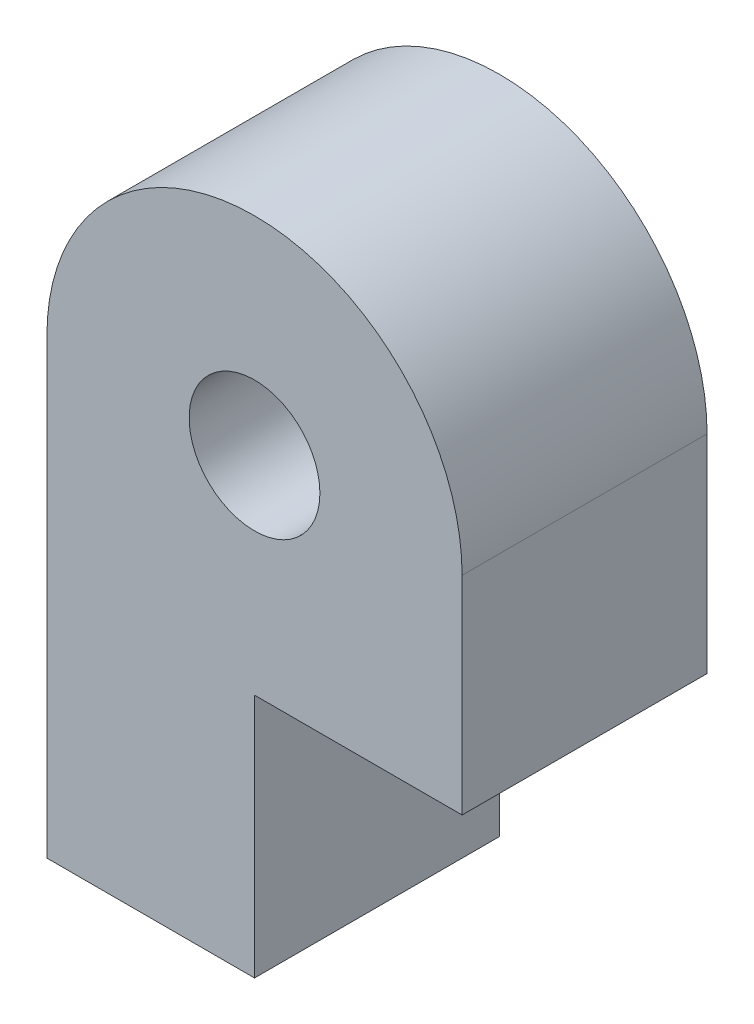
ISO-10303-21;
HEADER;
FILE_DESCRIPTION(('STEP AP214'),'2;1');
FILE_NAME('part.step','',(''),(''),'','','');
FILE_SCHEMA(('AUTOMOTIVE_DESIGN { 1 0 10303 214 1 1 1 1 }'));
ENDSEC;
DATA;
#1=APPLICATION_CONTEXT('core data for automotive mechanical design processes');
#2=APPLICATION_PROTOCOL_DEFINITION('international standard','automotive_design',2000,#1);
#3=PRODUCT_CONTEXT('',#1,'mechanical');
#4=PRODUCT('Part','Part','',(#3));
#5=PRODUCT_RELATED_PRODUCT_CATEGORY('part','',(#4));
#6=PRODUCT_DEFINITION_FORMATION('','',#4);
#7=PRODUCT_DEFINITION_CONTEXT('part definition',#1,'design');
#8=PRODUCT_DEFINITION('design','',#6,#7);
#9=PRODUCT_DEFINITION_SHAPE('','',#8);
#10=(LENGTH_UNIT() NAMED_UNIT(*) SI_UNIT(.MILLI.,.METRE.));
#11=(NAMED_UNIT(*) PLANE_ANGLE_UNIT() SI_UNIT($,.RADIAN.));
#12=(NAMED_UNIT(*) SI_UNIT($,.STERADIAN.) SOLID_ANGLE_UNIT());
#13=UNCERTAINTY_MEASURE_WITH_UNIT(LENGTH_MEASURE(1.E-05),#10,'distance_accuracy_value','');
#14=(GEOMETRIC_REPRESENTATION_CONTEXT(3) GLOBAL_UNCERTAINTY_ASSIGNED_CONTEXT((#13)) GLOBAL_UNIT_ASSIGNED_CONTEXT((#10,
#11,#12)) REPRESENTATION_CONTEXT('',''));
#15=CARTESIAN_POINT('',(0.,0.,0.));
#16=DIRECTION('',(0.,0.,1.));
#17=DIRECTION('',(1.,0.,0.));
#18=AXIS2_PLACEMENT_3D('',#15,#16,#17);
#19=CARTESIAN_POINT('',(0.,0.,5.9944));
#20=DIRECTION('',(0.,0.,1.));
#21=DIRECTION('',(1.,0.,0.));
#22=AXIS2_PLACEMENT_3D('',#19,#20,#21);
#23=PLANE('',#22);
#24=CARTESIAN_POINT('',(0.,0.,5.9944));
#25=DIRECTION('',(0.,0.,1.));
#26=DIRECTION('',(1.,0.,0.));
#27=AXIS2_PLACEMENT_3D('',#24,#25,#26);
#28=CIRCLE('',#27,5.08);
#29=CARTESIAN_POINT('',(5.08,0.,5.9944));
#30=VERTEX_POINT('',#29);
#31=CARTESIAN_POINT('',(-5.08,0.,5.9944));
#32=VERTEX_POINT('',#31);
#33=EDGE_CURVE('E129',#30,#32,#28,.T.);
#34=ORIENTED_EDGE('',*,*,#33,.T.);
#35=DIRECTION('',(0.,-1.,0.));
#36=VECTOR('',#35,1.);
#37=CARTESIAN_POINT('',(-5.08,0.,5.9944));
#38=LINE('',#37,#36);
#39=CARTESIAN_POINT('',(-5.08,-11.0744,5.9944));
#40=VERTEX_POINT('',#39);
#41=EDGE_CURVE('E87',#32,#40,#38,.T.);
#42=ORIENTED_EDGE('',*,*,#41,.T.);
#43=DIRECTION('',(1.,0.,0.));
#44=VECTOR('',#43,1.);
#45=CARTESIAN_POINT('',(-5.08,-11.0744,5.9944));
#46=LINE('',#45,#44);
#47=CARTESIAN_POINT('',(0.,-11.0744,5.9944));
#48=VERTEX_POINT('',#47);
#49=EDGE_CURVE('E100',#40,#48,#46,.T.);
#50=ORIENTED_EDGE('',*,*,#49,.T.);
#51=DIRECTION('',(0.,1.,0.));
#52=VECTOR('',#51,1.);
#53=CARTESIAN_POINT('',(0.,-11.0744,5.9944));
#54=LINE('',#53,#52);
#55=CARTESIAN_POINT('',(0.,-5.08,5.9944));
#56=VERTEX_POINT('',#55);
#57=EDGE_CURVE('E94',#48,#56,#54,.T.);
#58=ORIENTED_EDGE('',*,*,#57,.T.);
#59=DIRECTION('',(1.,0.,0.));
#60=VECTOR('',#59,1.);
#61=CARTESIAN_POINT('',(5.08,-5.08,5.9944));
#62=LINE('',#61,#60);
#63=CARTESIAN_POINT('',(5.08,-5.08,5.9944));
#64=VERTEX_POINT('',#63);
#65=EDGE_CURVE('E98',#56,#64,#62,.T.);
#66=ORIENTED_EDGE('',*,*,#65,.T.);
#67=DIRECTION('',(0.,1.,0.));
#68=VECTOR('',#67,1.);
#69=CARTESIAN_POINT('',(5.08,0.,5.9944));
#70=LINE('',#69,#68);
#71=EDGE_CURVE('E50',#64,#30,#70,.T.);
#72=ORIENTED_EDGE('',*,*,#71,.T.);
#73=EDGE_LOOP('',(#34,#42,#50,#58,#66,#72));
#74=FACE_BOUND('',#73,.T.);
#75=CARTESIAN_POINT('',(0.,0.,5.9944));
#76=DIRECTION('',(0.,0.,1.));
#77=DIRECTION('',(1.,0.,0.));
#78=AXIS2_PLACEMENT_3D('',#75,#76,#77);
#79=CIRCLE('',#78,1.6);
#80=CARTESIAN_POINT('',(1.6,0.,5.9944));
#81=VERTEX_POINT('',#80);
#82=EDGE_CURVE('E122',#81,#81,#79,.T.);
#83=ORIENTED_EDGE('',*,*,#82,.F.);
#84=EDGE_LOOP('',(#83));
#85=FACE_BOUND('',#84,.T.);
#86=ADVANCED_FACE('F33',(#74,#85),#23,.T.);
#87=CARTESIAN_POINT('',(0.,0.,0.));
#88=DIRECTION('',(0.,0.,1.));
#89=DIRECTION('',(1.,0.,0.));
#90=AXIS2_PLACEMENT_3D('',#87,#88,#89);
#91=PLANE('',#90);
#92=CARTESIAN_POINT('',(0.,0.,0.));
#93=DIRECTION('',(0.,0.,1.));
#94=DIRECTION('',(1.,0.,0.));
#95=AXIS2_PLACEMENT_3D('',#92,#93,#94);
#96=CIRCLE('',#95,5.08);
#97=CARTESIAN_POINT('',(5.08,0.,0.));
#98=VERTEX_POINT('',#97);
#99=CARTESIAN_POINT('',(-5.08,0.,0.));
#100=VERTEX_POINT('',#99);
#101=EDGE_CURVE('E118',#98,#100,#96,.T.);
#102=ORIENTED_EDGE('',*,*,#101,.F.);
#103=DIRECTION('',(0.,1.,0.));
#104=VECTOR('',#103,1.);
#105=CARTESIAN_POINT('',(5.08,0.,0.));
#106=LINE('',#105,#104);
#107=CARTESIAN_POINT('',(5.08,-5.08,0.));
#108=VERTEX_POINT('',#107);
#109=EDGE_CURVE('E79',#108,#98,#106,.T.);
#110=ORIENTED_EDGE('',*,*,#109,.F.);
#111=DIRECTION('',(1.,0.,0.));
#112=VECTOR('',#111,1.);
#113=CARTESIAN_POINT('',(5.08,-5.08,0.));
#114=LINE('',#113,#112);
#115=CARTESIAN_POINT('',(0.,-5.08,0.));
#116=VERTEX_POINT('',#115);
#117=EDGE_CURVE('E73',#116,#108,#114,.T.);
#118=ORIENTED_EDGE('',*,*,#117,.F.);
#119=DIRECTION('',(0.,1.,0.));
#120=VECTOR('',#119,1.);
#121=CARTESIAN_POINT('',(0.,-11.0744,0.));
#122=LINE('',#121,#120);
#123=CARTESIAN_POINT('',(0.,-11.0744,0.));
#124=VERTEX_POINT('',#123);
#125=EDGE_CURVE('E108',#124,#116,#122,.T.);
#126=ORIENTED_EDGE('',*,*,#125,.F.);
#127=DIRECTION('',(1.,0.,0.));
#128=VECTOR('',#127,1.);
#129=CARTESIAN_POINT('',(-5.08,-11.0744,0.));
#130=LINE('',#129,#128);
#131=CARTESIAN_POINT('',(-5.08,-11.0744,0.));
#132=VERTEX_POINT('',#131);
#133=EDGE_CURVE('E124',#132,#124,#130,.T.);
#134=ORIENTED_EDGE('',*,*,#133,.F.);
#135=DIRECTION('',(0.,-1.,0.));
#136=VECTOR('',#135,1.);
#137=CARTESIAN_POINT('',(-5.08,-5.08,0.));
#138=LINE('',#137,#136);
#139=EDGE_CURVE('E121',#100,#132,#138,.T.);
#140=ORIENTED_EDGE('',*,*,#139,.F.);
#141=EDGE_LOOP('',(#102,#110,#118,#126,#134,#140));
#142=FACE_BOUND('',#141,.T.);
#143=CARTESIAN_POINT('',(0.,0.,0.));
#144=DIRECTION('',(0.,0.,1.));
#145=DIRECTION('',(1.,0.,0.));
#146=AXIS2_PLACEMENT_3D('',#143,#144,#145);
#147=CIRCLE('',#146,1.6);
#148=CARTESIAN_POINT('',(1.6,0.,0.));
#149=VERTEX_POINT('',#148);
#150=EDGE_CURVE('E225',#149,#149,#147,.T.);
#151=ORIENTED_EDGE('',*,*,#150,.T.);
#152=EDGE_LOOP('',(#151));
#153=FACE_BOUND('',#152,.T.);
#154=ADVANCED_FACE('F138',(#142,#153),#91,.F.);
#155=CARTESIAN_POINT('',(0.,0.,5.9944));
#156=DIRECTION('',(0.,0.,-1.));
#157=DIRECTION('',(-1.,0.,0.));
#158=AXIS2_PLACEMENT_3D('',#155,#156,#157);
#159=CYLINDRICAL_SURFACE('',#158,5.08);
#160=ORIENTED_EDGE('',*,*,#101,.T.);
#161=DIRECTION('',(0.,0.,-1.));
#162=VECTOR('',#161,1.);
#163=CARTESIAN_POINT('',(-5.08,0.,5.9944));
#164=LINE('',#163,#162);
#165=EDGE_CURVE('E11',#32,#100,#164,.T.);
#166=ORIENTED_EDGE('',*,*,#165,.F.);
#167=ORIENTED_EDGE('',*,*,#33,.F.);
#168=DIRECTION('',(0.,0.,-1.));
#169=VECTOR('',#168,1.);
#170=CARTESIAN_POINT('',(5.08,0.,5.9944));
#171=LINE('',#170,#169);
#172=EDGE_CURVE('E114',#30,#98,#171,.T.);
#173=ORIENTED_EDGE('',*,*,#172,.T.);
#174=EDGE_LOOP('',(#160,#166,#167,#173));
#175=FACE_BOUND('',#174,.T.);
#176=ADVANCED_FACE('F35',(#175),#159,.T.);
#177=CARTESIAN_POINT('',(-5.08,-5.08,5.9944));
#178=DIRECTION('',(1.,0.,0.));
#179=DIRECTION('',(0.,1.,0.));
#180=AXIS2_PLACEMENT_3D('',#177,#178,#179);
#181=PLANE('',#180);
#182=ORIENTED_EDGE('',*,*,#139,.T.);
#183=DIRECTION('',(0.,0.,-1.));
#184=VECTOR('',#183,1.);
#185=CARTESIAN_POINT('',(-5.08,-11.0744,5.9944));
#186=LINE('',#185,#184);
#187=EDGE_CURVE('E42',#40,#132,#186,.T.);
#188=ORIENTED_EDGE('',*,*,#187,.F.);
#189=ORIENTED_EDGE('',*,*,#41,.F.);
#190=ORIENTED_EDGE('',*,*,#165,.T.);
#191=EDGE_LOOP('',(#182,#188,#189,#190));
#192=FACE_BOUND('',#191,.T.);
#193=ADVANCED_FACE('F163',(#192),#181,.F.);
#194=CARTESIAN_POINT('',(-5.08,-11.0744,5.9944));
#195=DIRECTION('',(0.,1.,0.));
#196=DIRECTION('',(0.,0.,1.));
#197=AXIS2_PLACEMENT_3D('',#194,#195,#196);
#198=PLANE('',#197);
#199=ORIENTED_EDGE('',*,*,#133,.T.);
#200=DIRECTION('',(0.,0.,-1.));
#201=VECTOR('',#200,1.);
#202=CARTESIAN_POINT('',(0.,-11.0744,5.9944));
#203=LINE('',#202,#201);
#204=EDGE_CURVE('E109',#48,#124,#203,.T.);
#205=ORIENTED_EDGE('',*,*,#204,.F.);
#206=ORIENTED_EDGE('',*,*,#49,.F.);
#207=ORIENTED_EDGE('',*,*,#187,.T.);
#208=EDGE_LOOP('',(#199,#205,#206,#207));
#209=FACE_BOUND('',#208,.T.);
#210=ADVANCED_FACE('F135',(#209),#198,.F.);
#211=CARTESIAN_POINT('',(0.,-11.0744,5.9944));
#212=DIRECTION('',(-1.,0.,0.));
#213=DIRECTION('',(0.,0.,1.));
#214=AXIS2_PLACEMENT_3D('',#211,#212,#213);
#215=PLANE('',#214);
#216=ORIENTED_EDGE('',*,*,#125,.T.);
#217=DIRECTION('',(0.,0.,-1.));
#218=VECTOR('',#217,1.);
#219=CARTESIAN_POINT('',(0.,-5.08,5.9944));
#220=LINE('',#219,#218);
#221=EDGE_CURVE('E105',#56,#116,#220,.T.);
#222=ORIENTED_EDGE('',*,*,#221,.F.);
#223=ORIENTED_EDGE('',*,*,#57,.F.);
#224=ORIENTED_EDGE('',*,*,#204,.T.);
#225=EDGE_LOOP('',(#216,#222,#223,#224));
#226=FACE_BOUND('',#225,.T.);
#227=ADVANCED_FACE('F106',(#226),#215,.F.);
#228=CARTESIAN_POINT('',(5.08,-5.08,5.9944));
#229=DIRECTION('',(0.,1.,0.));
#230=DIRECTION('',(0.,0.,1.));
#231=AXIS2_PLACEMENT_3D('',#228,#229,#230);
#232=PLANE('',#231);
#233=ORIENTED_EDGE('',*,*,#117,.T.);
#234=DIRECTION('',(0.,0.,-1.));
#235=VECTOR('',#234,1.);
#236=CARTESIAN_POINT('',(5.08,-5.08,5.9944));
#237=LINE('',#236,#235);
#238=EDGE_CURVE('E110',#64,#108,#237,.T.);
#239=ORIENTED_EDGE('',*,*,#238,.F.);
#240=ORIENTED_EDGE('',*,*,#65,.F.);
#241=ORIENTED_EDGE('',*,*,#221,.T.);
#242=EDGE_LOOP('',(#233,#239,#240,#241));
#243=FACE_BOUND('',#242,.T.);
#244=ADVANCED_FACE('F112',(#243),#232,.F.);
#245=CARTESIAN_POINT('',(5.08,0.,5.9944));
#246=DIRECTION('',(-1.,0.,0.));
#247=DIRECTION('',(0.,0.,1.));
#248=AXIS2_PLACEMENT_3D('',#245,#246,#247);
#249=PLANE('',#248);
#250=ORIENTED_EDGE('',*,*,#109,.T.);
#251=ORIENTED_EDGE('',*,*,#172,.F.);
#252=ORIENTED_EDGE('',*,*,#71,.F.);
#253=ORIENTED_EDGE('',*,*,#238,.T.);
#254=EDGE_LOOP('',(#250,#251,#252,#253));
#255=FACE_BOUND('',#254,.T.);
#256=ADVANCED_FACE('F143',(#255),#249,.F.);
#257=CARTESIAN_POINT('',(0.,0.,5.9944));
#258=DIRECTION('',(0.,0.,-1.));
#259=DIRECTION('',(-1.,0.,0.));
#260=AXIS2_PLACEMENT_3D('',#257,#258,#259);
#261=CYLINDRICAL_SURFACE('',#260,1.6);
#262=ORIENTED_EDGE('',*,*,#82,.T.);
#263=EDGE_LOOP('',(#262));
#264=FACE_BOUND('',#263,.T.);
#265=ORIENTED_EDGE('',*,*,#150,.F.);
#266=EDGE_LOOP('',(#265));
#267=FACE_BOUND('',#266,.T.);
#268=ADVANCED_FACE('F145',(#264,#267),#261,.F.);
#269=CLOSED_SHELL('',(#86,#154,#176,#193,#210,#227,#244,#256,#268));
#270=MANIFOLD_SOLID_BREP('B2',#269);
#271=ADVANCED_BREP_SHAPE_REPRESENTATION('',(#18,#270),#14);
#272=SHAPE_DEFINITION_REPRESENTATION(#9,#271);
ENDSEC;
END-ISO-10303-21;
